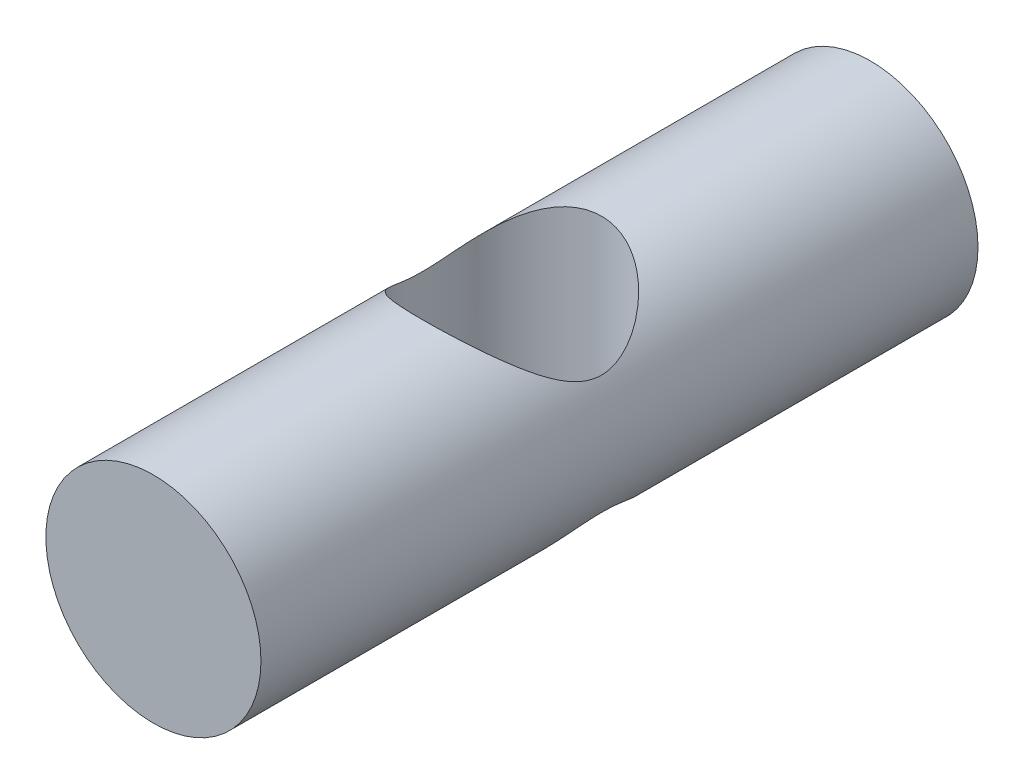
ISO-10303-21;
HEADER;
FILE_DESCRIPTION(('STEP AP214'),'2;1');
FILE_NAME('part.step','',(''),(''),'','','');
FILE_SCHEMA(('AUTOMOTIVE_DESIGN { 1 0 10303 214 1 1 1 1 }'));
ENDSEC;
DATA;
#1=APPLICATION_CONTEXT('core data for automotive mechanical design processes');
#2=APPLICATION_PROTOCOL_DEFINITION('international standard','automotive_design',2000,#1);
#3=PRODUCT_CONTEXT('',#1,'mechanical');
#4=PRODUCT('Part','Part','',(#3));
#5=PRODUCT_RELATED_PRODUCT_CATEGORY('part','',(#4));
#6=PRODUCT_DEFINITION_FORMATION('','',#4);
#7=PRODUCT_DEFINITION_CONTEXT('part definition',#1,'design');
#8=PRODUCT_DEFINITION('design','',#6,#7);
#9=PRODUCT_DEFINITION_SHAPE('','',#8);
#10=(LENGTH_UNIT() NAMED_UNIT(*) SI_UNIT(.MILLI.,.METRE.));
#11=(NAMED_UNIT(*) PLANE_ANGLE_UNIT() SI_UNIT($,.RADIAN.));
#12=(NAMED_UNIT(*) SI_UNIT($,.STERADIAN.) SOLID_ANGLE_UNIT());
#13=UNCERTAINTY_MEASURE_WITH_UNIT(LENGTH_MEASURE(1.E-05),#10,'distance_accuracy_value','');
#14=(GEOMETRIC_REPRESENTATION_CONTEXT(3) GLOBAL_UNCERTAINTY_ASSIGNED_CONTEXT((#13)) GLOBAL_UNIT_ASSIGNED_CONTEXT((#10,
#11,#12)) REPRESENTATION_CONTEXT('',''));
#15=CARTESIAN_POINT('',(0.,0.,0.));
#16=DIRECTION('',(0.,0.,1.));
#17=DIRECTION('',(1.,0.,0.));
#18=AXIS2_PLACEMENT_3D('',#15,#16,#17);
#19=CARTESIAN_POINT('',(0.,0.,20.));
#20=DIRECTION('',(0.,0.,-1.));
#21=DIRECTION('',(-1.,0.,0.));
#22=AXIS2_PLACEMENT_3D('',#19,#20,#21);
#23=CYLINDRICAL_SURFACE('',#22,6.);
#24=CARTESIAN_POINT('',(0.,-6.,5.));
#25=CARTESIAN_POINT('',(0.118803401095405,-6.00000636279643,5.0000064862677));
#26=CARTESIAN_POINT('',(0.237558182871218,-5.9964675633917,4.99576243276274));
#27=CARTESIAN_POINT('',(0.474087838067092,-5.98241218121961,4.97888342242901));
#28=CARTESIAN_POINT('',(0.591862597565708,-5.97189479839916,4.96624750352265));
#29=CARTESIAN_POINT('',(0.825474733693953,-5.94410935213455,4.93280067838579));
#30=CARTESIAN_POINT('',(0.941311384241483,-5.92683881527392,4.9119867768663));
#31=CARTESIAN_POINT('',(1.17018155731566,-5.88593383048317,4.86255145148515));
#32=CARTESIAN_POINT('',(1.28321381003106,-5.86229655516696,4.83392655878944));
#33=CARTESIAN_POINT('',(1.61550772291657,-5.78287450226039,4.73740362240781));
#34=CARTESIAN_POINT('',(1.82964493287683,-5.71836951829061,4.65860789353558));
#35=CARTESIAN_POINT('',(2.23973970904936,-5.57056793109677,4.47594785576944));
#36=CARTESIAN_POINT('',(2.43569110189251,-5.48726497939233,4.37207507698348));
#37=CARTESIAN_POINT('',(2.7487493551036,-5.33520303254702,4.17931765246547));
#38=CARTESIAN_POINT('',(2.87121824175386,-5.27015451867263,4.09605321766379));
#39=CARTESIAN_POINT('',(3.10654667374618,-5.13495608214751,3.92057491487891));
#40=CARTESIAN_POINT('',(3.21940634431806,-5.06480622600091,3.82836116355909));
#41=CARTESIAN_POINT('',(3.43568816068562,-4.92066908923446,3.63553308278675));
#42=CARTESIAN_POINT('',(3.53908406033977,-4.84667197890407,3.53489678957743));
#43=CARTESIAN_POINT('',(3.73607907111508,-4.69649318853079,3.32600704379389));
#44=CARTESIAN_POINT('',(3.82967941338621,-4.62031178455679,3.21775455132494));
#45=CARTESIAN_POINT('',(4.00872533168449,-4.46590940619064,2.99186847524311));
#46=CARTESIAN_POINT('',(4.09398918746846,-4.38767669457347,2.87409893732901));
#47=CARTESIAN_POINT('',(4.25431125048953,-4.23240914046916,2.63097870098595));
#48=CARTESIAN_POINT('',(4.32936604026975,-4.15537470670733,2.50562548412932));
#49=CARTESIAN_POINT('',(4.4688210493782,-4.0050115613057,2.24746866950541));
#50=CARTESIAN_POINT('',(4.53324636625595,-3.93167441297208,2.11468364253878));
#51=CARTESIAN_POINT('',(4.65107409789267,-3.79155403229088,1.84110422364287));
#52=CARTESIAN_POINT('',(4.70448590476211,-3.72476524134072,1.70031678782893));
#53=CARTESIAN_POINT('',(4.8038705578035,-3.59583630496641,1.39667622874439));
#54=CARTESIAN_POINT('',(4.84867766430581,-3.53471789619366,1.23299156369288));
#55=CARTESIAN_POINT('',(4.92202476595886,-3.43187191424553,0.896180811817697));
#56=CARTESIAN_POINT('',(4.95060424437364,-3.39009732197607,0.723078773763432));
#57=CARTESIAN_POINT('',(4.97982440219376,-3.34688431376343,0.457661896369309));
#58=CARTESIAN_POINT('',(4.98729261982802,-3.33571370000033,0.367618679010189));
#59=CARTESIAN_POINT('',(4.99733565959028,-3.3206515347262,0.186635888055953));
#60=CARTESIAN_POINT('',(4.99991093928053,-3.31675930257912,0.0956963990750678));
#61=CARTESIAN_POINT('',(5.00008454722766,-3.31649708247112,-0.086195355289506));
#62=CARTESIAN_POINT('',(4.99768286475912,-3.32012711072076,-0.177147620700306));
#63=CARTESIAN_POINT('',(4.98797701095387,-3.33469045716225,-0.358199787378118));
#64=CARTESIAN_POINT('',(4.9806722424497,-3.34562466496004,-0.448299583463618));
#65=CARTESIAN_POINT('',(4.9605577711742,-3.37538324774709,-0.634290345987521));
#66=CARTESIAN_POINT('',(4.94734291419499,-3.3947851529219,-0.730044329719767));
#67=CARTESIAN_POINT('',(4.9157405398429,-3.44038747060614,-0.91907203891122));
#68=CARTESIAN_POINT('',(4.89734936269664,-3.46659269219059,-1.01234395824117));
#69=CARTESIAN_POINT('',(4.83487145070514,-3.55374344299518,-1.28826795172829));
#70=CARTESIAN_POINT('',(4.78352415648848,-3.62315426397916,-1.46664526370663));
#71=CARTESIAN_POINT('',(4.67632227850057,-3.76004871810486,-1.77568076874676));
#72=CARTESIAN_POINT('',(4.62355194613134,-3.82500795712382,-1.90862269999418));
#73=CARTESIAN_POINT('',(4.50808681272013,-3.96043831206372,-2.16730339944136));
#74=CARTESIAN_POINT('',(4.44538619181528,-4.03091264789804,-2.29303788433664));
#75=CARTESIAN_POINT('',(4.31043075762212,-4.17491879023624,-2.53766285158917));
#76=CARTESIAN_POINT('',(4.23816312441515,-4.24845460689311,-2.65654383781025));
#77=CARTESIAN_POINT('',(4.0843540141714,-4.39652708661221,-2.88743564285202));
#78=CARTESIAN_POINT('',(4.00281439970954,-4.47106354601933,-2.99944783455588));
#79=CARTESIAN_POINT('',(3.82600354374307,-4.62342077684068,-3.22226109628928));
#80=CARTESIAN_POINT('',(3.73023700414124,-4.70120929265264,-3.33269201981388));
#81=CARTESIAN_POINT('',(3.52848927170201,-4.85446404087317,-3.54559939981486));
#82=CARTESIAN_POINT('',(3.42250656330085,-4.92992992652313,-3.64807467199064));
#83=CARTESIAN_POINT('',(3.20056123189973,-5.07681645366273,-3.84425294796649));
#84=CARTESIAN_POINT('',(3.08461970676718,-5.14824514018381,-3.9379736595021));
#85=CARTESIAN_POINT('',(2.84274064052496,-5.28566109460446,-4.11599426421234));
#86=CARTESIAN_POINT('',(2.71680273442448,-5.35164816363854,-4.20029381312783));
#87=CARTESIAN_POINT('',(2.38827463214803,-5.50853314592501,-4.39878554184217));
#88=CARTESIAN_POINT('',(2.17932731194453,-5.59498946786027,-4.50631929530225));
#89=CARTESIAN_POINT('',(1.8513717036081,-5.7084038705407,-4.64613821914312));
#90=CARTESIAN_POINT('',(1.73959798407547,-5.74350440601256,-4.68917312218695));
#91=CARTESIAN_POINT('',(1.51170856686385,-5.80764297166477,-4.76751793421716));
#92=CARTESIAN_POINT('',(1.39559507719869,-5.83668403661188,-4.80283171060456));
#93=CARTESIAN_POINT('',(1.15874024023432,-5.88830518104936,-4.86543453319276));
#94=CARTESIAN_POINT('',(1.03796855116844,-5.91082981449132,-4.89265476556204));
#95=CARTESIAN_POINT('',(0.79368071984195,-5.94855722519953,-4.93816722227972));
#96=CARTESIAN_POINT('',(0.670165967971719,-5.96376362711192,-4.9564638664516));
#97=CARTESIAN_POINT('',(0.421443909131281,-5.98648272603519,-4.98377697031546));
#98=CARTESIAN_POINT('',(0.296237084023917,-5.99399756851713,-4.99279601788868));
#99=CARTESIAN_POINT('',(0.0452813606587581,-6.00114166173048,-5.00137053830483));
#100=CARTESIAN_POINT('',(-0.0804674771283865,-6.00077177047715,-5.00092704086014));
#101=CARTESIAN_POINT('',(-0.316217699577987,-5.99267919208227,-4.9912131909085));
#102=CARTESIAN_POINT('',(-0.426296149457821,-5.98584511760915,-4.98300958868131));
#103=CARTESIAN_POINT('',(-0.645178571447258,-5.96622340308935,-4.95942180024422));
#104=CARTESIAN_POINT('',(-0.753982136950651,-5.95343391393135,-4.94403538382096));
#105=CARTESIAN_POINT('',(-0.969508932578344,-5.922153588973,-4.90632392627914));
#106=CARTESIAN_POINT('',(-1.07623280976896,-5.90366455762227,-4.88400108118507));
#107=CARTESIAN_POINT('',(-1.28701083316512,-5.86132925877314,-4.83274114539643));
#108=CARTESIAN_POINT('',(-1.39106394571243,-5.83748095091222,-4.80380153552005));
#109=CARTESIAN_POINT('',(-1.70100357204864,-5.7578099796654,-4.70677908129298));
#110=CARTESIAN_POINT('',(-1.90197317990273,-5.69426548906173,-4.62897463511253));
#111=CARTESIAN_POINT('',(-2.28736622034062,-5.55070829820292,-4.45119251532421));
#112=CARTESIAN_POINT('',(-2.4717835011244,-5.47068951124314,-4.35120664535609));
#113=CARTESIAN_POINT('',(-2.77431022087587,-5.32196402989804,-4.16241303362758));
#114=CARTESIAN_POINT('',(-2.89671891082123,-5.25618753965957,-4.07807881363138));
#115=CARTESIAN_POINT('',(-3.13182124456801,-5.11958730343164,-3.90043631108395));
#116=CARTESIAN_POINT('',(-3.24451452031805,-5.04876336641404,-3.80712768883631));
#117=CARTESIAN_POINT('',(-3.46039828484842,-4.9033290991082,-3.61204642318574));
#118=CARTESIAN_POINT('',(-3.56355916557859,-4.82870801884464,-3.51024916115612));
#119=CARTESIAN_POINT('',(-3.75997885952874,-4.67738428016308,-3.29899388009149));
#120=CARTESIAN_POINT('',(-3.85323906840847,-4.60068191705467,-3.18953694443026));
#121=CARTESIAN_POINT('',(-4.03144708201688,-4.44540721169772,-2.96121350414877));
#122=CARTESIAN_POINT('',(-4.11621624228699,-4.3668259708409,-2.84221365304651));
#123=CARTESIAN_POINT('',(-4.27543853436326,-4.21106013919063,-2.59654816531047));
#124=CARTESIAN_POINT('',(-4.34988795406828,-4.13387605960317,-2.46987979366074));
#125=CARTESIAN_POINT('',(-4.48797579821677,-3.98352281099524,-2.20902653418022));
#126=CARTESIAN_POINT('',(-4.55164272839413,-3.91034341321279,-2.07486275313425));
#127=CARTESIAN_POINT('',(-4.66777738062598,-3.77095158572992,-1.79841659242433));
#128=CARTESIAN_POINT('',(-4.72025536508448,-3.70473280033071,-1.6561418052561));
#129=CARTESIAN_POINT('',(-4.81674752553354,-3.57850891369613,-1.35146946258282));
#130=CARTESIAN_POINT('',(-4.85976816309609,-3.51940536010279,-1.18836978046225));
#131=CARTESIAN_POINT('',(-4.92964324178358,-3.42087013106355,-0.85305750676159));
#132=CARTESIAN_POINT('',(-4.95653805629938,-3.38138936984465,-0.680868858020014));
#133=CARTESIAN_POINT('',(-4.98335884043903,-3.34161185607346,-0.417267118823413));
#134=CARTESIAN_POINT('',(-4.9900439743412,-3.33159299706687,-0.327939885729363));
#135=CARTESIAN_POINT('',(-4.99859875462369,-3.31874657694375,-0.148522532583946));
#136=CARTESIAN_POINT('',(-5.00046880529626,-3.31591841207014,-0.0584324772192738));
#137=CARTESIAN_POINT('',(-4.99933140644564,-3.31763235091844,0.121644228189401));
#138=CARTESIAN_POINT('',(-4.99632384110741,-3.32217462964556,0.2116308757273));
#139=CARTESIAN_POINT('',(-4.98551920595954,-3.33836659549378,0.390705731690927));
#140=CARTESIAN_POINT('',(-4.97771962684742,-3.3500200062847,0.479793444537628));
#141=CARTESIAN_POINT('',(-4.95646386284238,-3.38139896959306,0.665670000297203));
#142=CARTESIAN_POINT('',(-4.94249693749092,-3.40184751901395,0.762277582327918));
#143=CARTESIAN_POINT('',(-4.90931375512976,-3.44956299936088,0.952897655384539));
#144=CARTESIAN_POINT('',(-4.89009367595845,-3.47683489368277,1.04690820177159));
#145=CARTESIAN_POINT('',(-4.82502893529809,-3.56715037769761,1.32490519247801));
#146=CARTESIAN_POINT('',(-4.7718260132866,-3.6386203494625,1.50447425917308));
#147=CARTESIAN_POINT('',(-4.66101333620415,-3.77905708413607,1.81560530153226));
#148=CARTESIAN_POINT('',(-4.60651894445035,-3.84555788327452,1.94948557461558));
#149=CARTESIAN_POINT('',(-4.48741065580201,-3.98390215298827,2.20989471783679));
#150=CARTESIAN_POINT('',(-4.42279087534716,-4.05574871700042,2.33641925480243));
#151=CARTESIAN_POINT('',(-4.2837858901639,-4.20230923095866,2.58247503937639));
#152=CARTESIAN_POINT('',(-4.20938767793866,-4.27702690475067,2.70199665984664));
#153=CARTESIAN_POINT('',(-4.0510934721615,-4.42725084654704,2.93399936330056));
#154=CARTESIAN_POINT('',(-3.96719939385688,-4.5027569527514,3.04648185894279));
#155=CARTESIAN_POINT('',(-3.78559728592261,-4.65661946215907,3.26970299172245));
#156=CARTESIAN_POINT('',(-3.68741297206341,-4.73493356113397,3.38008420704469));
#157=CARTESIAN_POINT('',(-3.48062708656674,-4.8889534769991,3.59266286414692));
#158=CARTESIAN_POINT('',(-3.37202387840542,-4.96465888158805,3.69485901563601));
#159=CARTESIAN_POINT('',(-3.144659631158,-5.11169145947055,3.89018127821456));
#160=CARTESIAN_POINT('',(-3.02592088507469,-5.18302767756749,3.98332637820861));
#161=CARTESIAN_POINT('',(-2.77827797167404,-5.31988980472137,4.1598471824308));
#162=CARTESIAN_POINT('',(-2.64937275881187,-5.385415114694,4.24322187964871));
#163=CARTESIAN_POINT('',(-2.31715775505751,-5.53880075702301,4.43658392581487));
#164=CARTESIAN_POINT('',(-2.10785901335212,-5.62226392609454,4.5401082380941));
#165=CARTESIAN_POINT('',(-1.78004652854698,-5.73103285742107,4.67390583373136));
#166=CARTESIAN_POINT('',(-1.66848545194813,-5.7645471565668,4.71491832045557));
#167=CARTESIAN_POINT('',(-1.44122911865485,-5.82552080229896,4.78927419077675));
#168=CARTESIAN_POINT('',(-1.32553443865742,-5.8529809897173,4.82261863938529));
#169=CARTESIAN_POINT('',(-1.01333234603959,-5.91714489125081,4.90034346391484));
#170=CARTESIAN_POINT('',(-0.81374559705322,-5.94804013902009,4.93754678243697));
#171=CARTESIAN_POINT('',(-0.409390797411387,-5.98946116455115,4.98736819813601));
#172=CARTESIAN_POINT('',(-0.204623282772274,-5.99998904091734,4.99998882825427));
#173=CARTESIAN_POINT('',(0.,-6.,5.));
#174=B_SPLINE_CURVE_WITH_KNOTS('',3,(#24,#25,#26,#27,#28,#29,#30,#31,#32,#33,#34,#35,#36,#37,
#38,#39,#40,#41,#42,#43,#44,#45,#46,#47,#48,#49,#50,#51,#52,#53,#54,#55,#56,#57,#58,#59,#60,#61,
#62,#63,#64,#65,#66,#67,#68,#69,#70,#71,#72,#73,#74,#75,#76,#77,#78,#79,#80,#81,#82,#83,#84,#85,
#86,#87,#88,#89,#90,#91,#92,#93,#94,#95,#96,#97,#98,#99,#100,#101,#102,#103,#104,#105,#106,#107,
#108,#109,#110,#111,#112,#113,#114,#115,#116,#117,#118,#119,#120,#121,#122,#123,#124,#125,#126,
#127,#128,#129,#130,#131,#132,#133,#134,#135,#136,#137,#138,#139,#140,#141,#142,#143,#144,#145,
#146,#147,#148,#149,#150,#151,#152,#153,#154,#155,#156,#157,#158,#159,#160,#161,#162,#163,#164,
#165,#166,#167,#168,#169,#170,#171,#172,#173),.UNSPECIFIED.,.T.,.F.,(4,2,2,2,2,2,2,2,2,2,2,2,2,
2,2,2,2,2,2,2,2,2,2,2,2,2,2,2,2,2,2,2,2,2,2,2,2,2,2,2,2,2,2,2,2,2,2,2,2,2,2,2,2,2,2,2,2,2,2,2,2,
2,2,2,2,2,2,2,2,2,2,2,2,2,4),(0.,0.356198531128419,0.712437905356867,1.06880787854775,
1.42533637270188,2.13333209783898,2.84156728725028,3.32622201622343,3.81087042808177,
4.29682459639559,4.78271761425373,5.27755036039961,5.77254834493272,6.26636031071477,
6.75974940543413,7.29936255278482,7.83765708456692,8.11040822806103,8.38313386402394,
8.65586008771504,8.92861953390792,9.22392701856221,9.51944381892724,10.1116379066242,
10.5823769120489,11.0533928323055,11.5250464324407,11.9966054526408,12.4928422896337,
12.9891528567514,13.484436760364,13.9797387562551,14.7274446962693,15.10150349884,
15.4753745093337,15.8523389140401,16.2291164194433,16.6057887984766,16.9824201883012,
17.3138076935885,17.6452981608744,17.9766837873554,18.3081957920453,18.9794342536,
19.6509211619365,20.1379627282136,20.6250227371037,21.1135480143902,21.6020043344423,
22.0992028034935,22.5965796576366,23.0926203414622,23.5882040850607,24.1228614856737,
24.6561746412001,24.9262177314022,25.196238147046,25.4662649741992,25.7364333195518,
26.0351569724179,26.3340985560114,26.9331443359533,27.4099325615984,27.8869988690867,
28.3647063284082,28.8423176087132,29.3434029116174,29.844567050611,30.3446559675372,
30.8447963820892,31.5852621624668,31.9553671316834,32.325420666041,32.9389891607904,
33.5524944315665),.UNSPECIFIED.);
#175=CARTESIAN_POINT('',(0.,-6.,5.));
#176=VERTEX_POINT('',#175);
#177=EDGE_CURVE('E10',#176,#176,#174,.T.);
#178=ORIENTED_EDGE('',*,*,#177,.T.);
#179=EDGE_LOOP('',(#178));
#180=FACE_BOUND('',#179,.T.);
#181=CARTESIAN_POINT('',(0.,6.,5.));
#182=CARTESIAN_POINT('',(-0.118803401095405,6.00000636279643,5.0000064862677));
#183=CARTESIAN_POINT('',(-0.237558182871218,5.9964675633917,4.99576243276274));
#184=CARTESIAN_POINT('',(-0.474087838067091,5.98241218121961,4.97888342242901));
#185=CARTESIAN_POINT('',(-0.591862597565708,5.97189479839916,4.96624750352265));
#186=CARTESIAN_POINT('',(-0.825474733693953,5.94410935213455,4.93280067838579));
#187=CARTESIAN_POINT('',(-0.941311384241483,5.92683881527392,4.9119867768663));
#188=CARTESIAN_POINT('',(-1.17018155731566,5.88593383048317,4.86255145148515));
#189=CARTESIAN_POINT('',(-1.28321381003106,5.86229655516696,4.83392655878944));
#190=CARTESIAN_POINT('',(-1.61550772291657,5.78287450226039,4.73740362240781));
#191=CARTESIAN_POINT('',(-1.82964493287683,5.71836951829061,4.65860789353558));
#192=CARTESIAN_POINT('',(-2.23973970904936,5.57056793109677,4.47594785576944));
#193=CARTESIAN_POINT('',(-2.43569110189251,5.48726497939233,4.37207507698348));
#194=CARTESIAN_POINT('',(-2.7487493551036,5.33520303254702,4.17931765246547));
#195=CARTESIAN_POINT('',(-2.87121824175386,5.27015451867263,4.09605321766379));
#196=CARTESIAN_POINT('',(-3.10654667374618,5.13495608214751,3.92057491487891));
#197=CARTESIAN_POINT('',(-3.21940634431806,5.06480622600091,3.82836116355909));
#198=CARTESIAN_POINT('',(-3.43568816068562,4.92066908923446,3.63553308278675));
#199=CARTESIAN_POINT('',(-3.53908406033977,4.84667197890407,3.53489678957743));
#200=CARTESIAN_POINT('',(-3.73607907111508,4.69649318853079,3.32600704379389));
#201=CARTESIAN_POINT('',(-3.82967941338621,4.62031178455679,3.21775455132494));
#202=CARTESIAN_POINT('',(-4.00872533168449,4.46590940619064,2.99186847524311));
#203=CARTESIAN_POINT('',(-4.09398918746846,4.38767669457347,2.87409893732901));
#204=CARTESIAN_POINT('',(-4.25431125048952,4.23240914046916,2.63097870098595));
#205=CARTESIAN_POINT('',(-4.32936604026974,4.15537470670733,2.50562548412932));
#206=CARTESIAN_POINT('',(-4.46882104937819,4.0050115613057,2.24746866950541));
#207=CARTESIAN_POINT('',(-4.53324636625595,3.93167441297209,2.11468364253878));
#208=CARTESIAN_POINT('',(-4.65107409789266,3.79155403229088,1.84110422364287));
#209=CARTESIAN_POINT('',(-4.70448590476211,3.72476524134072,1.70031678782893));
#210=CARTESIAN_POINT('',(-4.8038705578035,3.59583630496641,1.39667622874439));
#211=CARTESIAN_POINT('',(-4.84867766430581,3.53471789619366,1.23299156369288));
#212=CARTESIAN_POINT('',(-4.92202476595886,3.43187191424553,0.896180811817698));
#213=CARTESIAN_POINT('',(-4.95060424437364,3.39009732197607,0.723078773763433));
#214=CARTESIAN_POINT('',(-4.97982440219376,3.34688431376343,0.457661896369309));
#215=CARTESIAN_POINT('',(-4.98729261982802,3.33571370000033,0.36761867901019));
#216=CARTESIAN_POINT('',(-4.99733565959028,3.3206515347262,0.186635888055954));
#217=CARTESIAN_POINT('',(-4.99991093928053,3.31675930257912,0.0956963990750687));
#218=CARTESIAN_POINT('',(-5.00008454722766,3.31649708247112,-0.0861953552895054));
#219=CARTESIAN_POINT('',(-4.99768286475912,3.32012711072076,-0.177147620700305));
#220=CARTESIAN_POINT('',(-4.98797701095387,3.33469045716225,-0.358199787378118));
#221=CARTESIAN_POINT('',(-4.9806722424497,3.34562466496004,-0.448299583463618));
#222=CARTESIAN_POINT('',(-4.9605577711742,3.37538324774709,-0.63429034598752));
#223=CARTESIAN_POINT('',(-4.94734291419499,3.3947851529219,-0.730044329719766));
#224=CARTESIAN_POINT('',(-4.9157405398429,3.44038747060614,-0.919072038911219));
#225=CARTESIAN_POINT('',(-4.89734936269664,3.46659269219059,-1.01234395824117));
#226=CARTESIAN_POINT('',(-4.83487145070514,3.55374344299518,-1.28826795172829));
#227=CARTESIAN_POINT('',(-4.78352415648848,3.62315426397916,-1.46664526370663));
#228=CARTESIAN_POINT('',(-4.67632227850057,3.76004871810486,-1.77568076874675));
#229=CARTESIAN_POINT('',(-4.62355194613134,3.82500795712382,-1.90862269999418));
#230=CARTESIAN_POINT('',(-4.50808681272013,3.96043831206372,-2.16730339944136));
#231=CARTESIAN_POINT('',(-4.44538619181528,4.03091264789804,-2.29303788433664));
#232=CARTESIAN_POINT('',(-4.31043075762212,4.17491879023624,-2.53766285158917));
#233=CARTESIAN_POINT('',(-4.23816312441515,4.24845460689311,-2.65654383781025));
#234=CARTESIAN_POINT('',(-4.08435401417139,4.39652708661221,-2.88743564285202));
#235=CARTESIAN_POINT('',(-4.00281439970954,4.47106354601934,-2.99944783455588));
#236=CARTESIAN_POINT('',(-3.82600354374306,4.62342077684068,-3.22226109628928));
#237=CARTESIAN_POINT('',(-3.73023700414124,4.70120929265264,-3.33269201981388));
#238=CARTESIAN_POINT('',(-3.52848927170201,4.85446404087317,-3.54559939981486));
#239=CARTESIAN_POINT('',(-3.42250656330085,4.92992992652313,-3.64807467199064));
#240=CARTESIAN_POINT('',(-3.20056123189973,5.07681645366273,-3.84425294796649));
#241=CARTESIAN_POINT('',(-3.08461970676717,5.14824514018382,-3.9379736595021));
#242=CARTESIAN_POINT('',(-2.84274064052496,5.28566109460446,-4.11599426421235));
#243=CARTESIAN_POINT('',(-2.71680273442447,5.35164816363854,-4.20029381312783));
#244=CARTESIAN_POINT('',(-2.38827463214803,5.50853314592501,-4.39878554184217));
#245=CARTESIAN_POINT('',(-2.17932731194453,5.59498946786027,-4.50631929530225));
#246=CARTESIAN_POINT('',(-1.8513717036081,5.7084038705407,-4.64613821914312));
#247=CARTESIAN_POINT('',(-1.73959798407546,5.74350440601256,-4.68917312218695));
#248=CARTESIAN_POINT('',(-1.51170856686385,5.80764297166477,-4.76751793421716));
#249=CARTESIAN_POINT('',(-1.39559507719869,5.83668403661188,-4.80283171060456));
#250=CARTESIAN_POINT('',(-1.15874024023432,5.88830518104936,-4.86543453319277));
#251=CARTESIAN_POINT('',(-1.03796855116844,5.91082981449132,-4.89265476556204));
#252=CARTESIAN_POINT('',(-0.793680719841949,5.94855722519953,-4.93816722227972));
#253=CARTESIAN_POINT('',(-0.670165967971719,5.96376362711192,-4.9564638664516));
#254=CARTESIAN_POINT('',(-0.42144390913128,5.98648272603519,-4.98377697031546));
#255=CARTESIAN_POINT('',(-0.296237084023917,5.99399756851713,-4.99279601788868));
#256=CARTESIAN_POINT('',(-0.0452813606587575,6.00114166173048,-5.00137053830483));
#257=CARTESIAN_POINT('',(0.0804674771283871,6.00077177047715,-5.00092704086014));
#258=CARTESIAN_POINT('',(0.316217699577988,5.99267919208227,-4.9912131909085));
#259=CARTESIAN_POINT('',(0.426296149457822,5.98584511760915,-4.98300958868131));
#260=CARTESIAN_POINT('',(0.645178571447258,5.96622340308935,-4.95942180024422));
#261=CARTESIAN_POINT('',(0.753982136950652,5.95343391393135,-4.94403538382096));
#262=CARTESIAN_POINT('',(0.969508932578345,5.922153588973,-4.90632392627914));
#263=CARTESIAN_POINT('',(1.07623280976896,5.90366455762227,-4.88400108118507));
#264=CARTESIAN_POINT('',(1.28701083316512,5.86132925877314,-4.83274114539643));
#265=CARTESIAN_POINT('',(1.39106394571243,5.83748095091222,-4.80380153552005));
#266=CARTESIAN_POINT('',(1.70100357204864,5.7578099796654,-4.70677908129298));
#267=CARTESIAN_POINT('',(1.90197317990273,5.69426548906173,-4.62897463511253));
#268=CARTESIAN_POINT('',(2.28736622034062,5.55070829820292,-4.45119251532421));
#269=CARTESIAN_POINT('',(2.4717835011244,5.47068951124314,-4.35120664535609));
#270=CARTESIAN_POINT('',(2.77431022087587,5.32196402989804,-4.16241303362758));
#271=CARTESIAN_POINT('',(2.89671891082123,5.25618753965957,-4.07807881363138));
#272=CARTESIAN_POINT('',(3.13182124456801,5.11958730343164,-3.90043631108395));
#273=CARTESIAN_POINT('',(3.24451452031805,5.04876336641404,-3.80712768883631));
#274=CARTESIAN_POINT('',(3.46039828484842,4.9033290991082,-3.61204642318574));
#275=CARTESIAN_POINT('',(3.56355916557859,4.82870801884464,-3.51024916115612));
#276=CARTESIAN_POINT('',(3.75997885952874,4.67738428016308,-3.29899388009149));
#277=CARTESIAN_POINT('',(3.85323906840847,4.60068191705467,-3.18953694443026));
#278=CARTESIAN_POINT('',(4.03144708201688,4.44540721169772,-2.96121350414877));
#279=CARTESIAN_POINT('',(4.11621624228699,4.3668259708409,-2.84221365304651));
#280=CARTESIAN_POINT('',(4.27543853436326,4.21106013919063,-2.59654816531047));
#281=CARTESIAN_POINT('',(4.34988795406828,4.13387605960317,-2.46987979366074));
#282=CARTESIAN_POINT('',(4.48797579821677,3.98352281099524,-2.20902653418022));
#283=CARTESIAN_POINT('',(4.55164272839413,3.91034341321279,-2.07486275313425));
#284=CARTESIAN_POINT('',(4.66777738062598,3.77095158572992,-1.79841659242433));
#285=CARTESIAN_POINT('',(4.72025536508448,3.70473280033071,-1.6561418052561));
#286=CARTESIAN_POINT('',(4.81674752553354,3.57850891369613,-1.35146946258282));
#287=CARTESIAN_POINT('',(4.85976816309609,3.51940536010279,-1.18836978046225));
#288=CARTESIAN_POINT('',(4.92964324178358,3.42087013106355,-0.853057506761591));
#289=CARTESIAN_POINT('',(4.95653805629938,3.38138936984465,-0.680868858020015));
#290=CARTESIAN_POINT('',(4.98335884043903,3.34161185607347,-0.417267118823413));
#291=CARTESIAN_POINT('',(4.9900439743412,3.33159299706687,-0.327939885729363));
#292=CARTESIAN_POINT('',(4.99859875462369,3.31874657694375,-0.148522532583946));
#293=CARTESIAN_POINT('',(5.00046880529626,3.31591841207014,-0.0584324772192743));
#294=CARTESIAN_POINT('',(4.99933140644564,3.31763235091844,0.121644228189401));
#295=CARTESIAN_POINT('',(4.99632384110741,3.32217462964556,0.2116308757273));
#296=CARTESIAN_POINT('',(4.98551920595954,3.33836659549378,0.390705731690927));
#297=CARTESIAN_POINT('',(4.97771962684742,3.3500200062847,0.479793444537629));
#298=CARTESIAN_POINT('',(4.95646386284238,3.38139896959306,0.665670000297205));
#299=CARTESIAN_POINT('',(4.94249693749092,3.40184751901396,0.762277582327921));
#300=CARTESIAN_POINT('',(4.90931375512976,3.44956299936088,0.952897655384544));
#301=CARTESIAN_POINT('',(4.89009367595844,3.47683489368277,1.0469082017716));
#302=CARTESIAN_POINT('',(4.82502893529809,3.56715037769761,1.32490519247802));
#303=CARTESIAN_POINT('',(4.7718260132866,3.6386203494625,1.50447425917308));
#304=CARTESIAN_POINT('',(4.66101333620415,3.77905708413607,1.81560530153226));
#305=CARTESIAN_POINT('',(4.60651894445035,3.84555788327452,1.94948557461558));
#306=CARTESIAN_POINT('',(4.48741065580201,3.98390215298827,2.2098947178368));
#307=CARTESIAN_POINT('',(4.42279087534716,4.05574871700042,2.33641925480244));
#308=CARTESIAN_POINT('',(4.2837858901639,4.20230923095866,2.58247503937639));
#309=CARTESIAN_POINT('',(4.20938767793866,4.27702690475068,2.70199665984664));
#310=CARTESIAN_POINT('',(4.0510934721615,4.42725084654704,2.93399936330056));
#311=CARTESIAN_POINT('',(3.96719939385688,4.5027569527514,3.04648185894279));
#312=CARTESIAN_POINT('',(3.78559728592261,4.65661946215907,3.26970299172245));
#313=CARTESIAN_POINT('',(3.68741297206341,4.73493356113397,3.3800842070447));
#314=CARTESIAN_POINT('',(3.48062708656674,4.8889534769991,3.59266286414692));
#315=CARTESIAN_POINT('',(3.37202387840542,4.96465888158805,3.69485901563601));
#316=CARTESIAN_POINT('',(3.144659631158,5.11169145947055,3.89018127821456));
#317=CARTESIAN_POINT('',(3.02592088507468,5.18302767756749,3.98332637820862));
#318=CARTESIAN_POINT('',(2.77827797167403,5.31988980472137,4.1598471824308));
#319=CARTESIAN_POINT('',(2.64937275881186,5.385415114694,4.24322187964872));
#320=CARTESIAN_POINT('',(2.3171577550575,5.53880075702301,4.43658392581487));
#321=CARTESIAN_POINT('',(2.10785901335211,5.62226392609454,4.5401082380941));
#322=CARTESIAN_POINT('',(1.78004652854698,5.73103285742107,4.67390583373137));
#323=CARTESIAN_POINT('',(1.66848545194812,5.7645471565668,4.71491832045557));
#324=CARTESIAN_POINT('',(1.44122911865485,5.82552080229896,4.78927419077675));
#325=CARTESIAN_POINT('',(1.32553443865741,5.8529809897173,4.8226186393853));
#326=CARTESIAN_POINT('',(1.01333234603959,5.91714489125081,4.90034346391484));
#327=CARTESIAN_POINT('',(0.813745597053217,5.94804013902009,4.93754678243697));
#328=CARTESIAN_POINT('',(0.409390797411385,5.98946116455115,4.98736819813601));
#329=CARTESIAN_POINT('',(0.204623282772273,5.99998904091734,4.99998882825427));
#330=CARTESIAN_POINT('',(0.,6.,5.));
#331=B_SPLINE_CURVE_WITH_KNOTS('',3,(#181,#182,#183,#184,#185,#186,#187,#188,#189,#190,#191,
#192,#193,#194,#195,#196,#197,#198,#199,#200,#201,#202,#203,#204,#205,#206,#207,#208,#209,#210,
#211,#212,#213,#214,#215,#216,#217,#218,#219,#220,#221,#222,#223,#224,#225,#226,#227,#228,#229,
#230,#231,#232,#233,#234,#235,#236,#237,#238,#239,#240,#241,#242,#243,#244,#245,#246,#247,#248,
#249,#250,#251,#252,#253,#254,#255,#256,#257,#258,#259,#260,#261,#262,#263,#264,#265,#266,#267,
#268,#269,#270,#271,#272,#273,#274,#275,#276,#277,#278,#279,#280,#281,#282,#283,#284,#285,#286,
#287,#288,#289,#290,#291,#292,#293,#294,#295,#296,#297,#298,#299,#300,#301,#302,#303,#304,#305,
#306,#307,#308,#309,#310,#311,#312,#313,#314,#315,#316,#317,#318,#319,#320,#321,#322,#323,#324,
#325,#326,#327,#328,#329,#330),.UNSPECIFIED.,.T.,.F.,(4,2,2,2,2,2,2,2,2,2,2,2,2,2,2,2,2,2,2,2,2,
2,2,2,2,2,2,2,2,2,2,2,2,2,2,2,2,2,2,2,2,2,2,2,2,2,2,2,2,2,2,2,2,2,2,2,2,2,2,2,2,2,2,2,2,2,2,2,2,
2,2,2,2,2,4),(0.,0.356198531128419,0.712437905356867,1.06880787854775,1.42533637270188,
2.13333209783898,2.84156728725027,3.32622201622343,3.81087042808177,4.29682459639559,
4.78271761425373,5.27755036039961,5.77254834493272,6.26636031071476,6.75974940543413,
7.29936255278482,7.83765708456692,8.11040822806103,8.38313386402394,8.65586008771504,
8.92861953390792,9.22392701856221,9.51944381892724,10.1116379066242,10.5823769120489,
11.0533928323055,11.5250464324407,11.9966054526408,12.4928422896337,12.9891528567514,
13.484436760364,13.9797387562551,14.7274446962693,15.1015034988401,15.4753745093337,
15.8523389140401,16.2291164194433,16.6057887984766,16.9824201883012,17.3138076935885,
17.6452981608744,17.9766837873554,18.3081957920453,18.9794342536,19.6509211619365,
20.1379627282136,20.6250227371037,21.1135480143902,21.6020043344423,22.0992028034935,
22.5965796576366,23.0926203414622,23.5882040850607,24.1228614856737,24.6561746412001,
24.9262177314022,25.196238147046,25.4662649741992,25.7364333195518,26.0351569724179,
26.3340985560114,26.9331443359533,27.4099325615984,27.8869988690867,28.3647063284082,
28.8423176087132,29.3434029116174,29.844567050611,30.3446559675372,30.8447963820892,
31.5852621624668,31.9553671316834,32.325420666041,32.9389891607904,33.5524944315665),.UNSPECIFIED.);
#332=CARTESIAN_POINT('',(0.,6.,5.));
#333=VERTEX_POINT('',#332);
#334=EDGE_CURVE('E43',#333,#333,#331,.T.);
#335=ORIENTED_EDGE('',*,*,#334,.T.);
#336=EDGE_LOOP('',(#335));
#337=FACE_BOUND('',#336,.T.);
#338=CARTESIAN_POINT('',(0.,0.,20.));
#339=DIRECTION('',(0.,0.,1.));
#340=DIRECTION('',(1.,0.,0.));
#341=AXIS2_PLACEMENT_3D('',#338,#339,#340);
#342=CIRCLE('',#341,6.);
#343=CARTESIAN_POINT('',(6.,0.,20.));
#344=VERTEX_POINT('',#343);
#345=EDGE_CURVE('E47',#344,#344,#342,.T.);
#346=ORIENTED_EDGE('',*,*,#345,.F.);
#347=EDGE_LOOP('',(#346));
#348=FACE_BOUND('',#347,.T.);
#349=CARTESIAN_POINT('',(0.,0.,-20.));
#350=DIRECTION('',(0.,0.,1.));
#351=DIRECTION('',(1.,0.,0.));
#352=AXIS2_PLACEMENT_3D('',#349,#350,#351);
#353=CIRCLE('',#352,6.);
#354=CARTESIAN_POINT('',(6.,0.,-20.));
#355=VERTEX_POINT('',#354);
#356=EDGE_CURVE('E51',#355,#355,#353,.T.);
#357=ORIENTED_EDGE('',*,*,#356,.T.);
#358=EDGE_LOOP('',(#357));
#359=FACE_BOUND('',#358,.T.);
#360=ADVANCED_FACE('F33',(#180,#337,#348,#359),#23,.T.);
#361=CARTESIAN_POINT('',(0.,0.,20.));
#362=DIRECTION('',(0.,0.,1.));
#363=DIRECTION('',(1.,0.,0.));
#364=AXIS2_PLACEMENT_3D('',#361,#362,#363);
#365=PLANE('',#364);
#366=ORIENTED_EDGE('',*,*,#345,.T.);
#367=EDGE_LOOP('',(#366));
#368=FACE_BOUND('',#367,.T.);
#369=ADVANCED_FACE('F62',(#368),#365,.T.);
#370=CARTESIAN_POINT('',(0.,0.,-20.));
#371=DIRECTION('',(0.,0.,1.));
#372=DIRECTION('',(1.,0.,0.));
#373=AXIS2_PLACEMENT_3D('',#370,#371,#372);
#374=PLANE('',#373);
#375=ORIENTED_EDGE('',*,*,#356,.F.);
#376=EDGE_LOOP('',(#375));
#377=FACE_BOUND('',#376,.T.);
#378=ADVANCED_FACE('F60',(#377),#374,.F.);
#379=CARTESIAN_POINT('',(0.,-6.,0.));
#380=DIRECTION('',(0.,1.,0.));
#381=DIRECTION('',(0.,0.,1.));
#382=AXIS2_PLACEMENT_3D('',#379,#380,#381);
#383=CYLINDRICAL_SURFACE('',#382,5.);
#384=ORIENTED_EDGE('',*,*,#334,.F.);
#385=EDGE_LOOP('',(#384));
#386=FACE_BOUND('',#385,.T.);
#387=ORIENTED_EDGE('',*,*,#177,.F.);
#388=EDGE_LOOP('',(#387));
#389=FACE_BOUND('',#388,.T.);
#390=ADVANCED_FACE('F56',(#386,#389),#383,.F.);
#391=CLOSED_SHELL('',(#360,#369,#378,#390));
#392=MANIFOLD_SOLID_BREP('B2',#391);
#393=ADVANCED_BREP_SHAPE_REPRESENTATION('',(#18,#392),#14);
#394=SHAPE_DEFINITION_REPRESENTATION(#9,#393);
ENDSEC;
END-ISO-10303-21;
